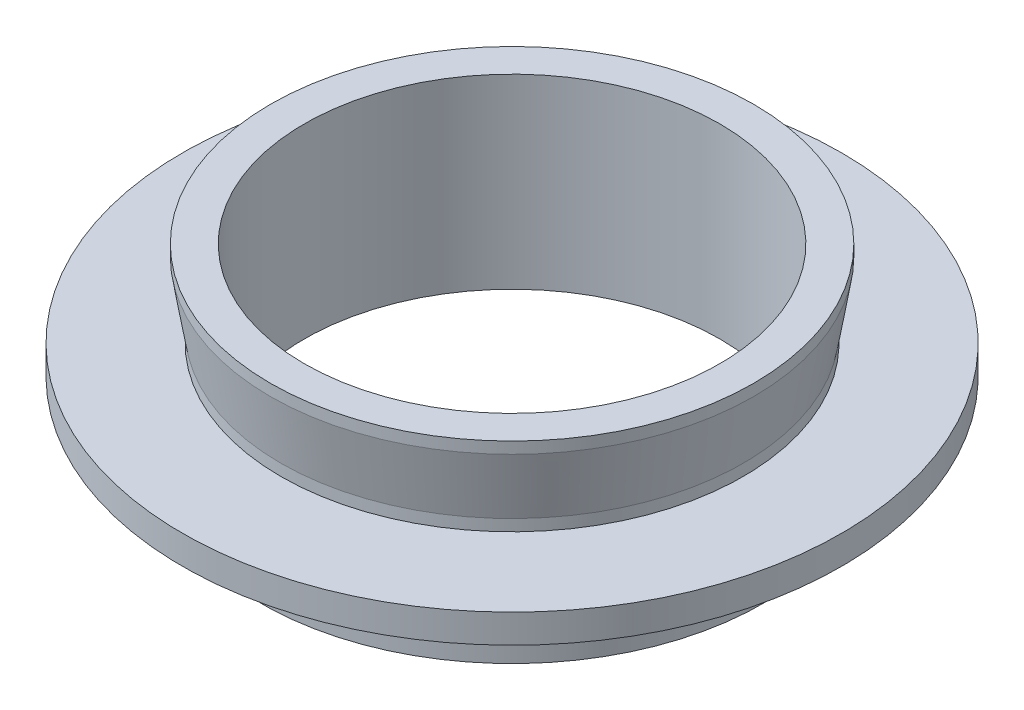
ISO-10303-21;
HEADER;
FILE_DESCRIPTION(('STEP AP214'),'2;1');
FILE_NAME('part.step','',(''),(''),'','','');
FILE_SCHEMA(('AUTOMOTIVE_DESIGN { 1 0 10303 214 1 1 1 1 }'));
ENDSEC;
DATA;
#1=APPLICATION_CONTEXT('core data for automotive mechanical design processes');
#2=APPLICATION_PROTOCOL_DEFINITION('international standard','automotive_design',2000,#1);
#3=PRODUCT_CONTEXT('',#1,'mechanical');
#4=PRODUCT('Part','Part','',(#3));
#5=PRODUCT_RELATED_PRODUCT_CATEGORY('part','',(#4));
#6=PRODUCT_DEFINITION_FORMATION('','',#4);
#7=PRODUCT_DEFINITION_CONTEXT('part definition',#1,'design');
#8=PRODUCT_DEFINITION('design','',#6,#7);
#9=PRODUCT_DEFINITION_SHAPE('','',#8);
#10=(LENGTH_UNIT() NAMED_UNIT(*) SI_UNIT(.MILLI.,.METRE.));
#11=(NAMED_UNIT(*) PLANE_ANGLE_UNIT() SI_UNIT($,.RADIAN.));
#12=(NAMED_UNIT(*) SI_UNIT($,.STERADIAN.) SOLID_ANGLE_UNIT());
#13=UNCERTAINTY_MEASURE_WITH_UNIT(LENGTH_MEASURE(1.E-05),#10,'distance_accuracy_value','');
#14=(GEOMETRIC_REPRESENTATION_CONTEXT(3) GLOBAL_UNCERTAINTY_ASSIGNED_CONTEXT((#13)) GLOBAL_UNIT_ASSIGNED_CONTEXT((#10,
#11,#12)) REPRESENTATION_CONTEXT('',''));
#15=CARTESIAN_POINT('',(0.,0.,0.));
#16=DIRECTION('',(0.,0.,1.));
#17=DIRECTION('',(1.,0.,0.));
#18=AXIS2_PLACEMENT_3D('',#15,#16,#17);
#19=CARTESIAN_POINT('',(-17.5,0.,0.));
#20=DIRECTION('',(0.,1.,0.));
#21=DIRECTION('',(0.,0.,1.));
#22=AXIS2_PLACEMENT_3D('',#19,#20,#21);
#23=PLANE('',#22);
#24=CARTESIAN_POINT('',(0.,0.,0.));
#25=DIRECTION('',(0.,-1.,0.));
#26=DIRECTION('',(0.,0.,-1.));
#27=AXIS2_PLACEMENT_3D('',#24,#25,#26);
#28=CIRCLE('',#27,14.5);
#29=CARTESIAN_POINT('',(0.,0.,-14.5));
#30=VERTEX_POINT('',#29);
#31=EDGE_CURVE('E10',#30,#30,#28,.T.);
#32=ORIENTED_EDGE('',*,*,#31,.F.);
#33=EDGE_LOOP('',(#32));
#34=FACE_BOUND('',#33,.T.);
#35=CARTESIAN_POINT('',(0.,0.,0.));
#36=DIRECTION('',(0.,-1.,0.));
#37=DIRECTION('',(0.,0.,-1.));
#38=AXIS2_PLACEMENT_3D('',#35,#36,#37);
#39=CIRCLE('',#38,17.5);
#40=CARTESIAN_POINT('',(0.,0.,-17.5));
#41=VERTEX_POINT('',#40);
#42=EDGE_CURVE('E76',#41,#41,#39,.T.);
#43=ORIENTED_EDGE('',*,*,#42,.T.);
#44=EDGE_LOOP('',(#43));
#45=FACE_BOUND('',#44,.T.);
#46=ADVANCED_FACE('F36',(#34,#45),#23,.F.);
#47=CARTESIAN_POINT('',(0.,0.,0.));
#48=DIRECTION('',(0.,-1.,0.));
#49=DIRECTION('',(0.,0.,-1.));
#50=AXIS2_PLACEMENT_3D('',#47,#48,#49);
#51=CYLINDRICAL_SURFACE('',#50,14.5);
#52=CARTESIAN_POINT('',(0.,13.,0.));
#53=DIRECTION('',(0.,-1.,0.));
#54=DIRECTION('',(0.,0.,-1.));
#55=AXIS2_PLACEMENT_3D('',#52,#53,#54);
#56=CIRCLE('',#55,14.5);
#57=CARTESIAN_POINT('',(0.,13.,-14.5));
#58=VERTEX_POINT('',#57);
#59=EDGE_CURVE('E42',#58,#58,#56,.T.);
#60=ORIENTED_EDGE('',*,*,#59,.F.);
#61=EDGE_LOOP('',(#60));
#62=FACE_BOUND('',#61,.T.);
#63=ORIENTED_EDGE('',*,*,#31,.T.);
#64=EDGE_LOOP('',(#63));
#65=FACE_BOUND('',#64,.T.);
#66=ADVANCED_FACE('F137',(#62,#65),#51,.F.);
#67=CARTESIAN_POINT('',(-14.5,13.,0.));
#68=DIRECTION('',(0.,-1.,0.));
#69=DIRECTION('',(0.,0.,-1.));
#70=AXIS2_PLACEMENT_3D('',#67,#68,#69);
#71=PLANE('',#70);
#72=CARTESIAN_POINT('',(0.,13.,0.));
#73=DIRECTION('',(0.,-1.,0.));
#74=DIRECTION('',(0.,0.,-1.));
#75=AXIS2_PLACEMENT_3D('',#72,#73,#74);
#76=CIRCLE('',#75,16.865);
#77=CARTESIAN_POINT('',(0.,13.,-16.865));
#78=VERTEX_POINT('',#77);
#79=EDGE_CURVE('E46',#78,#78,#76,.T.);
#80=ORIENTED_EDGE('',*,*,#79,.F.);
#81=EDGE_LOOP('',(#80));
#82=FACE_BOUND('',#81,.T.);
#83=ORIENTED_EDGE('',*,*,#59,.T.);
#84=EDGE_LOOP('',(#83));
#85=FACE_BOUND('',#84,.T.);
#86=ADVANCED_FACE('F132',(#82,#85),#71,.F.);
#87=CARTESIAN_POINT('',(0.,0.,0.));
#88=DIRECTION('',(0.,-1.,0.));
#89=DIRECTION('',(0.,0.,-1.));
#90=AXIS2_PLACEMENT_3D('',#87,#88,#89);
#91=CYLINDRICAL_SURFACE('',#90,16.865);
#92=CARTESIAN_POINT('',(0.,12.2,0.));
#93=DIRECTION('',(0.,-1.,0.));
#94=DIRECTION('',(0.,0.,-1.));
#95=AXIS2_PLACEMENT_3D('',#92,#93,#94);
#96=CIRCLE('',#95,16.865);
#97=CARTESIAN_POINT('',(0.,12.2,-16.865));
#98=VERTEX_POINT('',#97);
#99=EDGE_CURVE('E50',#98,#98,#96,.T.);
#100=ORIENTED_EDGE('',*,*,#99,.F.);
#101=EDGE_LOOP('',(#100));
#102=FACE_BOUND('',#101,.T.);
#103=ORIENTED_EDGE('',*,*,#79,.T.);
#104=EDGE_LOOP('',(#103));
#105=FACE_BOUND('',#104,.T.);
#106=ADVANCED_FACE('F126',(#102,#105),#91,.T.);
#107=CARTESIAN_POINT('',(0.,12.2,0.));
#108=DIRECTION('',(0.,1.,0.));
#109=DIRECTION('',(0.,0.,1.));
#110=AXIS2_PLACEMENT_3D('',#107,#108,#109);
#111=CONICAL_SURFACE('',#110,16.865,0.164411486247024);
#112=CARTESIAN_POINT('',(0.,7.8,0.));
#113=DIRECTION('',(0.,-1.,0.));
#114=DIRECTION('',(0.,0.,-1.));
#115=AXIS2_PLACEMENT_3D('',#112,#113,#114);
#116=CIRCLE('',#115,16.135);
#117=CARTESIAN_POINT('',(0.,7.8,-16.135));
#118=VERTEX_POINT('',#117);
#119=EDGE_CURVE('E55',#118,#118,#116,.T.);
#120=ORIENTED_EDGE('',*,*,#119,.F.);
#121=EDGE_LOOP('',(#120));
#122=FACE_BOUND('',#121,.T.);
#123=ORIENTED_EDGE('',*,*,#99,.T.);
#124=EDGE_LOOP('',(#123));
#125=FACE_BOUND('',#124,.T.);
#126=ADVANCED_FACE('F120',(#122,#125),#111,.T.);
#127=CARTESIAN_POINT('',(0.,0.,0.));
#128=DIRECTION('',(0.,-1.,0.));
#129=DIRECTION('',(0.,0.,-1.));
#130=AXIS2_PLACEMENT_3D('',#127,#128,#129);
#131=CYLINDRICAL_SURFACE('',#130,16.135);
#132=CARTESIAN_POINT('',(0.,7.,0.));
#133=DIRECTION('',(0.,-1.,0.));
#134=DIRECTION('',(0.,0.,-1.));
#135=AXIS2_PLACEMENT_3D('',#132,#133,#134);
#136=CIRCLE('',#135,16.135);
#137=CARTESIAN_POINT('',(0.,7.,-16.135));
#138=VERTEX_POINT('',#137);
#139=EDGE_CURVE('E58',#138,#138,#136,.T.);
#140=ORIENTED_EDGE('',*,*,#139,.F.);
#141=EDGE_LOOP('',(#140));
#142=FACE_BOUND('',#141,.T.);
#143=ORIENTED_EDGE('',*,*,#119,.T.);
#144=EDGE_LOOP('',(#143));
#145=FACE_BOUND('',#144,.T.);
#146=ADVANCED_FACE('F114',(#142,#145),#131,.T.);
#147=CARTESIAN_POINT('',(-16.135,7.,0.));
#148=DIRECTION('',(0.,-1.,0.));
#149=DIRECTION('',(0.,0.,-1.));
#150=AXIS2_PLACEMENT_3D('',#147,#148,#149);
#151=PLANE('',#150);
#152=CARTESIAN_POINT('',(0.,7.,0.));
#153=DIRECTION('',(0.,-1.,0.));
#154=DIRECTION('',(0.,0.,-1.));
#155=AXIS2_PLACEMENT_3D('',#152,#153,#154);
#156=CIRCLE('',#155,23.);
#157=CARTESIAN_POINT('',(0.,7.,-23.));
#158=VERTEX_POINT('',#157);
#159=EDGE_CURVE('E61',#158,#158,#156,.T.);
#160=ORIENTED_EDGE('',*,*,#159,.F.);
#161=EDGE_LOOP('',(#160));
#162=FACE_BOUND('',#161,.T.);
#163=ORIENTED_EDGE('',*,*,#139,.T.);
#164=EDGE_LOOP('',(#163));
#165=FACE_BOUND('',#164,.T.);
#166=ADVANCED_FACE('F108',(#162,#165),#151,.F.);
#167=CARTESIAN_POINT('',(0.,0.,0.));
#168=DIRECTION('',(0.,-1.,0.));
#169=DIRECTION('',(0.,0.,-1.));
#170=AXIS2_PLACEMENT_3D('',#167,#168,#169);
#171=CYLINDRICAL_SURFACE('',#170,23.);
#172=CARTESIAN_POINT('',(0.,5.,0.));
#173=DIRECTION('',(0.,-1.,0.));
#174=DIRECTION('',(0.,0.,-1.));
#175=AXIS2_PLACEMENT_3D('',#172,#173,#174);
#176=CIRCLE('',#175,23.);
#177=CARTESIAN_POINT('',(0.,5.,-23.));
#178=VERTEX_POINT('',#177);
#179=EDGE_CURVE('E64',#178,#178,#176,.T.);
#180=ORIENTED_EDGE('',*,*,#179,.F.);
#181=EDGE_LOOP('',(#180));
#182=FACE_BOUND('',#181,.T.);
#183=ORIENTED_EDGE('',*,*,#159,.T.);
#184=EDGE_LOOP('',(#183));
#185=FACE_BOUND('',#184,.T.);
#186=ADVANCED_FACE('F102',(#182,#185),#171,.T.);
#187=CARTESIAN_POINT('',(-23.,5.,0.));
#188=DIRECTION('',(0.,1.,0.));
#189=DIRECTION('',(0.,0.,1.));
#190=AXIS2_PLACEMENT_3D('',#187,#188,#189);
#191=PLANE('',#190);
#192=CARTESIAN_POINT('',(0.,5.,0.));
#193=DIRECTION('',(0.,-1.,0.));
#194=DIRECTION('',(0.,0.,-1.));
#195=AXIS2_PLACEMENT_3D('',#192,#193,#194);
#196=CIRCLE('',#195,17.1);
#197=CARTESIAN_POINT('',(0.,5.,-17.1));
#198=VERTEX_POINT('',#197);
#199=EDGE_CURVE('E67',#198,#198,#196,.T.);
#200=ORIENTED_EDGE('',*,*,#199,.F.);
#201=EDGE_LOOP('',(#200));
#202=FACE_BOUND('',#201,.T.);
#203=ORIENTED_EDGE('',*,*,#179,.T.);
#204=EDGE_LOOP('',(#203));
#205=FACE_BOUND('',#204,.T.);
#206=ADVANCED_FACE('F96',(#202,#205),#191,.F.);
#207=CARTESIAN_POINT('',(0.,0.,0.));
#208=DIRECTION('',(0.,-1.,0.));
#209=DIRECTION('',(0.,0.,-1.));
#210=AXIS2_PLACEMENT_3D('',#207,#208,#209);
#211=CYLINDRICAL_SURFACE('',#210,17.1);
#212=CARTESIAN_POINT('',(0.,4.,0.));
#213=DIRECTION('',(0.,-1.,0.));
#214=DIRECTION('',(0.,0.,-1.));
#215=AXIS2_PLACEMENT_3D('',#212,#213,#214);
#216=CIRCLE('',#215,17.1);
#217=CARTESIAN_POINT('',(0.,4.,-17.1));
#218=VERTEX_POINT('',#217);
#219=EDGE_CURVE('E70',#218,#218,#216,.T.);
#220=ORIENTED_EDGE('',*,*,#219,.F.);
#221=EDGE_LOOP('',(#220));
#222=FACE_BOUND('',#221,.T.);
#223=ORIENTED_EDGE('',*,*,#199,.T.);
#224=EDGE_LOOP('',(#223));
#225=FACE_BOUND('',#224,.T.);
#226=ADVANCED_FACE('F90',(#222,#225),#211,.T.);
#227=CARTESIAN_POINT('',(-17.1,4.,0.));
#228=DIRECTION('',(0.,-1.,0.));
#229=DIRECTION('',(0.,0.,-1.));
#230=AXIS2_PLACEMENT_3D('',#227,#228,#229);
#231=PLANE('',#230);
#232=CARTESIAN_POINT('',(0.,4.,0.));
#233=DIRECTION('',(0.,-1.,0.));
#234=DIRECTION('',(0.,0.,-1.));
#235=AXIS2_PLACEMENT_3D('',#232,#233,#234);
#236=CIRCLE('',#235,17.5);
#237=CARTESIAN_POINT('',(0.,4.,-17.5));
#238=VERTEX_POINT('',#237);
#239=EDGE_CURVE('E73',#238,#238,#236,.T.);
#240=ORIENTED_EDGE('',*,*,#239,.F.);
#241=EDGE_LOOP('',(#240));
#242=FACE_BOUND('',#241,.T.);
#243=ORIENTED_EDGE('',*,*,#219,.T.);
#244=EDGE_LOOP('',(#243));
#245=FACE_BOUND('',#244,.T.);
#246=ADVANCED_FACE('F84',(#242,#245),#231,.F.);
#247=CARTESIAN_POINT('',(0.,0.,0.));
#248=DIRECTION('',(0.,-1.,0.));
#249=DIRECTION('',(0.,0.,-1.));
#250=AXIS2_PLACEMENT_3D('',#247,#248,#249);
#251=CYLINDRICAL_SURFACE('',#250,17.5);
#252=ORIENTED_EDGE('',*,*,#42,.F.);
#253=EDGE_LOOP('',(#252));
#254=FACE_BOUND('',#253,.T.);
#255=ORIENTED_EDGE('',*,*,#239,.T.);
#256=EDGE_LOOP('',(#255));
#257=FACE_BOUND('',#256,.T.);
#258=ADVANCED_FACE('F81',(#254,#257),#251,.T.);
#259=CLOSED_SHELL('',(#46,#66,#86,#106,#126,#146,#166,#186,#206,#226,#246,#258));
#260=MANIFOLD_SOLID_BREP('B2',#259);
#261=ADVANCED_BREP_SHAPE_REPRESENTATION('',(#18,#260),#14);
#262=SHAPE_DEFINITION_REPRESENTATION(#9,#261);
ENDSEC;
END-ISO-10303-21;
